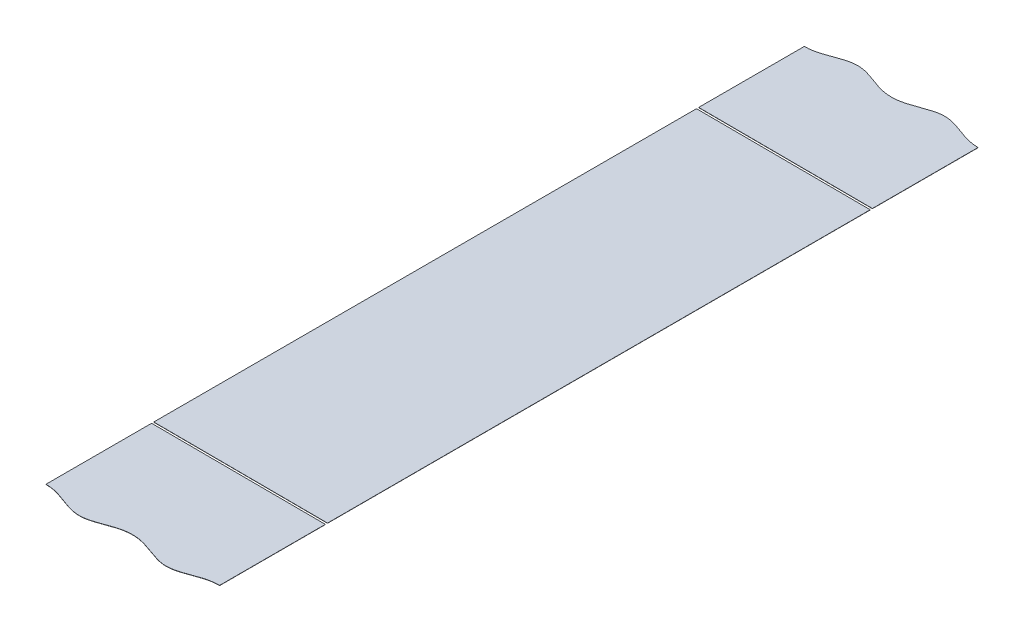
ISO-10303-21;
HEADER;
FILE_DESCRIPTION(('STEP AP214'),'2;1');
FILE_NAME('part.step','',(''),(''),'','','');
FILE_SCHEMA(('AUTOMOTIVE_DESIGN { 1 0 10303 214 1 1 1 1 }'));
ENDSEC;
DATA;
#1=APPLICATION_CONTEXT('core data for automotive mechanical design processes');
#2=APPLICATION_PROTOCOL_DEFINITION('international standard','automotive_design',2000,#1);
#3=PRODUCT_CONTEXT('',#1,'mechanical');
#4=PRODUCT('Part','Part','',(#3));
#5=PRODUCT_RELATED_PRODUCT_CATEGORY('part','',(#4));
#6=PRODUCT_DEFINITION_FORMATION('','',#4);
#7=PRODUCT_DEFINITION_CONTEXT('part definition',#1,'design');
#8=PRODUCT_DEFINITION('design','',#6,#7);
#9=PRODUCT_DEFINITION_SHAPE('','',#8);
#10=(LENGTH_UNIT() NAMED_UNIT(*) SI_UNIT(.MILLI.,.METRE.));
#11=(NAMED_UNIT(*) PLANE_ANGLE_UNIT() SI_UNIT($,.RADIAN.));
#12=(NAMED_UNIT(*) SI_UNIT($,.STERADIAN.) SOLID_ANGLE_UNIT());
#13=UNCERTAINTY_MEASURE_WITH_UNIT(LENGTH_MEASURE(1.E-05),#10,'distance_accuracy_value','');
#14=(GEOMETRIC_REPRESENTATION_CONTEXT(3) GLOBAL_UNCERTAINTY_ASSIGNED_CONTEXT((#13)) GLOBAL_UNIT_ASSIGNED_CONTEXT((#10,
#11,#12)) REPRESENTATION_CONTEXT('',''));
#15=CARTESIAN_POINT('',(0.,0.,0.));
#16=DIRECTION('',(0.,0.,1.));
#17=DIRECTION('',(1.,0.,0.));
#18=AXIS2_PLACEMENT_3D('',#15,#16,#17);
#19=CARTESIAN_POINT('',(4168.1005756017,241.081393417632,-3638.43675179829));
#20=DIRECTION('',(-0.00396825396825354,-0.999992126449225,0.));
#21=DIRECTION('',(0.999992126449225,-0.00396825396825354,0.));
#22=AXIS2_PLACEMENT_3D('',#19,#20,#21);
#23=PLANE('',#22);
#24=DIRECTION('',(0.,0.,1.));
#25=VECTOR('',#24,1.);
#26=CARTESIAN_POINT('',(702.95,254.83209920674,-173.258892942776));
#27=LINE('',#26,#25);
#28=CARTESIAN_POINT('',(702.95,254.83209920674,125.));
#29=VERTEX_POINT('',#28);
#30=CARTESIAN_POINT('',(702.95,254.83209920674,173.258892942778));
#31=VERTEX_POINT('',#30);
#32=EDGE_CURVE('E60',#29,#31,#27,.T.);
#33=ORIENTED_EDGE('',*,*,#32,.F.);
#34=DIRECTION('',(0.999992126449225,-0.00396825396825359,0.));
#35=VECTOR('',#34,1.);
#36=CARTESIAN_POINT('',(623.568727970466,255.147106734704,125.));
#37=LINE('',#36,#35);
#38=CARTESIAN_POINT('',(623.568727970466,255.147106734704,125.));
#39=VERTEX_POINT('',#38);
#40=EDGE_CURVE('E14',#39,#29,#37,.T.);
#41=ORIENTED_EDGE('',*,*,#40,.F.);
#42=DIRECTION('',(0.,0.,1.));
#43=VECTOR('',#42,1.);
#44=CARTESIAN_POINT('',(623.568727970466,255.147106734704,-173.258892942776));
#45=LINE('',#44,#43);
#46=CARTESIAN_POINT('',(623.568727970466,255.147106734704,173.258892942778));
#47=VERTEX_POINT('',#46);
#48=EDGE_CURVE('E99',#39,#47,#45,.T.);
#49=ORIENTED_EDGE('',*,*,#48,.T.);
#50=CARTESIAN_POINT('',(702.949999999999,254.83209920674,173.258892942778));
#51=CARTESIAN_POINT('',(701.68422899363,254.837122147107,173.262181964567));
#52=CARTESIAN_POINT('',(699.172229042036,254.847090479369,173.594043649429));
#53=CARTESIAN_POINT('',(697.270082255702,254.854638740334,174.060682929472));
#54=CARTESIAN_POINT('',(696.04662349184,254.859493773655,174.416832263334));
#55=CARTESIAN_POINT('',(694.840296012853,254.864280825152,174.812585823099));
#56=CARTESIAN_POINT('',(694.192108566333,254.866853017811,175.042429600881));
#57=CARTESIAN_POINT('',(693.671695664184,254.868918164635,175.226965213347));
#58=CARTESIAN_POINT('',(692.688110401866,254.872821311487,175.590430017711));
#59=CARTESIAN_POINT('',(692.089017730252,254.875198682077,175.813837373958));
#60=CARTESIAN_POINT('',(691.060219343337,254.879281247502,176.196387133234));
#61=CARTESIAN_POINT('',(690.582141485889,254.881178396795,176.368655333894));
#62=CARTESIAN_POINT('',(689.924126814083,254.883789586687,176.605761072537));
#63=CARTESIAN_POINT('',(689.37923722073,254.885951864002,176.787943810229));
#64=CARTESIAN_POINT('',(688.735479248461,254.888506479244,177.003182991211));
#65=CARTESIAN_POINT('',(687.516743056346,254.893342772054,177.360619471103));
#66=CARTESIAN_POINT('',(686.274490006288,254.898272386463,177.654620614531));
#67=CARTESIAN_POINT('',(685.017872425806,254.903259003426,177.863733960108));
#68=CARTESIAN_POINT('',(683.745174377142,254.908309432272,177.972702687079));
#69=CARTESIAN_POINT('',(682.468857623376,254.913374221173,177.970446612031));
#70=CARTESIAN_POINT('',(681.201141582182,254.918404879993,177.858558946605));
#71=CARTESIAN_POINT('',(679.941057024337,254.923405254911,177.645700578425));
#72=CARTESIAN_POINT('',(678.698193118115,254.928337293372,177.348581299583));
#73=CARTESIAN_POINT('',(677.476058328821,254.933187072784,176.988091569661));
#74=CARTESIAN_POINT('',(676.823802387974,254.935775410389,176.769001725331));
#75=CARTESIAN_POINT('',(676.277005403181,254.937945256778,176.585335071221));
#76=CARTESIAN_POINT('',(675.611889131558,254.940584627844,176.345009222586));
#77=CARTESIAN_POINT('',(675.10651054821,254.942590114203,176.162401245445));
#78=CARTESIAN_POINT('',(674.108031977849,254.946552361949,175.790352551658));
#79=CARTESIAN_POINT('',(673.452742495641,254.949152737511,175.54645203417));
#80=CARTESIAN_POINT('',(673.201943030092,254.950147981321,175.453902139972));
#81=CARTESIAN_POINT('',(672.52273282483,254.952843281135,175.20326032741));
#82=CARTESIAN_POINT('',(671.99684817901,254.954930141399,175.017436874896));
#83=CARTESIAN_POINT('',(671.354447508284,254.957479370481,174.79044201684));
#84=CARTESIAN_POINT('',(670.154590982691,254.962240743389,174.398791378027));
#85=CARTESIAN_POINT('',(668.928275087826,254.967107114621,174.044131462145));
#86=CARTESIAN_POINT('',(667.025022141484,254.974659765144,173.582330072409));
#87=CARTESIAN_POINT('',(664.512522065049,254.984630082044,173.257759265704));
#88=CARTESIAN_POINT('',(661.973551208773,254.994705442549,173.259910186328));
#89=CARTESIAN_POINT('',(659.459291308993,255.00468274293,173.588777752625));
#90=CARTESIAN_POINT('',(657.553976956267,255.012243573702,174.053907976769));
#91=CARTESIAN_POINT('',(656.326725230627,255.017113658577,174.410361999102));
#92=CARTESIAN_POINT('',(655.121848722104,255.021894952209,174.804901080956));
#93=CARTESIAN_POINT('',(654.210250272982,255.025512434855,175.127798721967));
#94=CARTESIAN_POINT('',(653.605769205923,255.027911188134,175.347135198893));
#95=CARTESIAN_POINT('',(653.109729966213,255.029879613314,175.530381794819));
#96=CARTESIAN_POINT('',(652.82135584475,255.031023964076,175.637418729192));
#97=CARTESIAN_POINT('',(652.333700540308,255.03295911941,175.819222063989));
#98=CARTESIAN_POINT('',(652.056773534054,255.034058044754,175.922195060746));
#99=CARTESIAN_POINT('',(651.328496107682,255.036948057295,176.192998945415));
#100=CARTESIAN_POINT('',(650.856739082017,255.038820123724,176.3630926515));
#101=CARTESIAN_POINT('',(650.189378143851,255.041468402267,176.603712057451));
#102=CARTESIAN_POINT('',(649.639862859984,255.043649035642,176.787455501291));
#103=CARTESIAN_POINT('',(648.991226750085,255.046223008725,177.004342339804));
#104=CARTESIAN_POINT('',(647.772803092478,255.051058061309,177.361352407472));
#105=CARTESIAN_POINT('',(646.530225361015,255.055988964146,177.655434399111));
#106=CARTESIAN_POINT('',(645.276912894528,255.060962465474,177.863499320998));
#107=CARTESIAN_POINT('',(644.020253803574,255.065949247162,177.971590688309));
#108=CARTESIAN_POINT('',(643.370039597925,255.068529482579,177.971592118867));
#109=CARTESIAN_POINT('',(642.714757532447,255.07112982871,177.969893734916));
#110=CARTESIAN_POINT('',(641.450639786084,255.07614620847,177.857095902083));
#111=CARTESIAN_POINT('',(640.198536683787,255.081114910696,177.645252564257));
#112=CARTESIAN_POINT('',(638.958875873977,255.086034238356,177.348985097284));
#113=CARTESIAN_POINT('',(637.741556649385,255.090864908234,176.989998054833));
#114=CARTESIAN_POINT('',(637.095401112578,255.093429037696,176.773175791965));
#115=CARTESIAN_POINT('',(636.547750628174,255.095602271015,176.589407626987));
#116=CARTESIAN_POINT('',(635.882185119416,255.098243424782,176.349029955348));
#117=CARTESIAN_POINT('',(635.376461009202,255.10025028229,176.166381091329));
#118=CARTESIAN_POINT('',(634.381403352169,255.104198954876,175.795652436497));
#119=CARTESIAN_POINT('',(633.731190795399,255.10677918375,175.553614996835));
#120=CARTESIAN_POINT('',(633.484492236871,255.107758153992,175.46253320474));
#121=CARTESIAN_POINT('',(632.803922669696,255.110458848142,175.211265032792));
#122=CARTESIAN_POINT('',(632.279350529977,255.112540500007,175.025687758424));
#123=CARTESIAN_POINT('',(631.632700386287,255.11510659221,174.796923090899));
#124=CARTESIAN_POINT('',(630.43445146361,255.119861585691,174.405274388551));
#125=CARTESIAN_POINT('',(629.222142717166,255.124672372563,174.053649251437));
#126=CARTESIAN_POINT('',(627.327236131078,255.132191902348,173.590508998445));
#127=CARTESIAN_POINT('',(624.826350678899,255.142116129107,173.262160753963));
#128=CARTESIAN_POINT('',(623.568727970465,255.147106734704,173.258892942778));
#129=B_SPLINE_CURVE_WITH_KNOTS('',2,(#50,#51,#52,#53,#54,#55,#56,#57,#58,#59,#60,#61,#62,#63,
#64,#65,#66,#67,#68,#69,#70,#71,#72,#73,#74,#75,#76,#77,#78,#79,#80,#81,#82,#83,#84,#85,#86,#87,
#88,#89,#90,#91,#92,#93,#94,#95,#96,#97,#98,#99,#100,#101,#102,#103,#104,#105,#106,#107,#108,
#109,#110,#111,#112,#113,#114,#115,#116,#117,#118,#119,#120,#121,#122,#123,#124,#125,#126,#127,
#128),.UNSPECIFIED.,.F.,.F.,(3,1,1,1,1,2,1,1,1,2,2,1,1,1,1,1,1,1,1,1,2,2,1,1,2,2,1,1,1,1,1,1,1,
1,1,1,1,1,1,1,2,2,2,1,1,1,1,1,1,1,1,1,1,2,2,1,1,2,2,1,1,1,1,3),(0.,0.03125,0.0625,0.078125,
0.09375,0.109375,0.125,0.1328125,0.140625,0.15625,0.171875,0.1875,0.203125,0.21875,0.234375,
0.25,0.265625,0.28125,0.296875,0.3125,0.328125,0.34375,0.359375,0.3671875,0.375,0.390625,
0.40625,0.421875,0.4375,0.46875,0.5,0.53125,0.5625,0.578125,0.59375,0.609375,0.6171875,0.625,
0.62890625,0.6328125,0.640625,0.65625,0.671875,0.6875,0.703125,0.71875,0.734146118164062,
0.749542236328125,0.75,0.765625,0.78125,0.796875,0.8125,0.828125,0.84375,0.859375,0.8671875,
0.875,0.890625,0.90625,0.921875,0.9375,0.96875,1.),.UNSPECIFIED.);
#130=EDGE_CURVE('E121',#31,#47,#129,.T.);
#131=ORIENTED_EDGE('',*,*,#130,.F.);
#132=EDGE_LOOP('',(#33,#41,#49,#131));
#133=FACE_BOUND('',#132,.T.);
#134=ADVANCED_FACE('F57',(#133),#23,.F.);
#135=CARTESIAN_POINT('',(4168.10017877631,240.981394204987,-3638.43675179829));
#136=DIRECTION('',(-0.00396825396825354,-0.999992126449225,0.));
#137=DIRECTION('',(0.999992126449225,-0.00396825396825354,0.));
#138=AXIS2_PLACEMENT_3D('',#135,#136,#137);
#139=PLANE('',#138);
#140=DIRECTION('',(-0.999992126449225,0.00396825396825354,0.));
#141=VECTOR('',#140,1.);
#142=CARTESIAN_POINT('',(4168.1001787763,240.981394204987,125.));
#143=LINE('',#142,#141);
#144=CARTESIAN_POINT('',(702.949603174603,254.732099994095,125.));
#145=VERTEX_POINT('',#144);
#146=CARTESIAN_POINT('',(623.568331145069,255.047107522059,125.));
#147=VERTEX_POINT('',#146);
#148=EDGE_CURVE('E83',#145,#147,#143,.T.);
#149=ORIENTED_EDGE('',*,*,#148,.F.);
#150=DIRECTION('',(0.,0.,1.));
#151=VECTOR('',#150,1.);
#152=CARTESIAN_POINT('',(702.949603174603,254.732099994095,-173.258892942776));
#153=LINE('',#152,#151);
#154=CARTESIAN_POINT('',(702.949603174603,254.732099994095,173.258892942778));
#155=VERTEX_POINT('',#154);
#156=EDGE_CURVE('E105',#145,#155,#153,.T.);
#157=ORIENTED_EDGE('',*,*,#156,.T.);
#158=CARTESIAN_POINT('',(702.949603174603,254.732099994095,173.258892942778));
#159=CARTESIAN_POINT('',(701.683832168233,254.737122934462,173.262181964567));
#160=CARTESIAN_POINT('',(699.171832216639,254.747091266725,173.594043649429));
#161=CARTESIAN_POINT('',(697.269685430305,254.754639527689,174.060682929472));
#162=CARTESIAN_POINT('',(696.046226666443,254.75949456101,174.416832263334));
#163=CARTESIAN_POINT('',(694.839899187456,254.764281612507,174.812585823099));
#164=CARTESIAN_POINT('',(694.191711740937,254.766853805166,175.042429600881));
#165=CARTESIAN_POINT('',(693.671298838787,254.76891895199,175.226965213347));
#166=CARTESIAN_POINT('',(692.687713576469,254.772822098842,175.590430017711));
#167=CARTESIAN_POINT('',(692.088620904855,254.775199469432,175.813837373958));
#168=CARTESIAN_POINT('',(691.05982251794,254.779282034857,176.196387133234));
#169=CARTESIAN_POINT('',(690.581744660492,254.78117918415,176.368655333894));
#170=CARTESIAN_POINT('',(689.923729988686,254.783790374042,176.605761072537));
#171=CARTESIAN_POINT('',(689.378840395333,254.785952651358,176.787943810229));
#172=CARTESIAN_POINT('',(688.735082423064,254.7885072666,177.003182991211));
#173=CARTESIAN_POINT('',(687.516346230949,254.793343559409,177.360619471103));
#174=CARTESIAN_POINT('',(686.274093180891,254.798273173818,177.654620614531));
#175=CARTESIAN_POINT('',(685.017475600409,254.803259790781,177.863733960108));
#176=CARTESIAN_POINT('',(683.744777551745,254.808310219627,177.972702687079));
#177=CARTESIAN_POINT('',(682.46846079798,254.813375008528,177.970446612031));
#178=CARTESIAN_POINT('',(681.200744756785,254.818405667348,177.858558946605));
#179=CARTESIAN_POINT('',(679.94066019894,254.823406042266,177.645700578425));
#180=CARTESIAN_POINT('',(678.697796292718,254.828338080727,177.348581299583));
#181=CARTESIAN_POINT('',(677.475661503424,254.833187860139,176.988091569661));
#182=CARTESIAN_POINT('',(676.823405562577,254.835776197744,176.769001725331));
#183=CARTESIAN_POINT('',(676.276608577784,254.837946044133,176.585335071221));
#184=CARTESIAN_POINT('',(675.611492306161,254.840585415199,176.345009222586));
#185=CARTESIAN_POINT('',(675.106113722813,254.842590901558,176.162401245445));
#186=CARTESIAN_POINT('',(674.107635152452,254.846553149304,175.790352551658));
#187=CARTESIAN_POINT('',(673.452345670244,254.849153524866,175.54645203417));
#188=CARTESIAN_POINT('',(673.201546204696,254.850148768677,175.453902139972));
#189=CARTESIAN_POINT('',(672.522335999434,254.85284406849,175.20326032741));
#190=CARTESIAN_POINT('',(671.996451353613,254.854930928754,175.017436874896));
#191=CARTESIAN_POINT('',(671.354050682887,254.857480157836,174.79044201684));
#192=CARTESIAN_POINT('',(670.154194157294,254.862241530744,174.398791378027));
#193=CARTESIAN_POINT('',(668.927878262429,254.867107901976,174.044131462145));
#194=CARTESIAN_POINT('',(667.024625316087,254.874660552499,173.582330072409));
#195=CARTESIAN_POINT('',(664.512125239652,254.8846308694,173.257759265704));
#196=CARTESIAN_POINT('',(661.973154383376,254.894706229904,173.259910186328));
#197=CARTESIAN_POINT('',(659.458894483596,254.904683530285,173.588777752625));
#198=CARTESIAN_POINT('',(657.55358013087,254.912244361057,174.053907976769));
#199=CARTESIAN_POINT('',(656.32632840523,254.917114445932,174.410361999102));
#200=CARTESIAN_POINT('',(655.121451896707,254.921895739564,174.804901080956));
#201=CARTESIAN_POINT('',(654.209853447585,254.92551322221,175.127798721967));
#202=CARTESIAN_POINT('',(653.605372380526,254.927911975489,175.347135198893));
#203=CARTESIAN_POINT('',(653.109333140816,254.929880400669,175.530381794819));
#204=CARTESIAN_POINT('',(652.820959019353,254.931024751431,175.637418729192));
#205=CARTESIAN_POINT('',(652.333303714912,254.932959906765,175.819222063989));
#206=CARTESIAN_POINT('',(652.056376708657,254.934058832109,175.922195060746));
#207=CARTESIAN_POINT('',(651.328099282285,254.936948844651,176.192998945415));
#208=CARTESIAN_POINT('',(650.85634225662,254.93882091108,176.3630926515));
#209=CARTESIAN_POINT('',(650.188981318454,254.941469189622,176.603712057451));
#210=CARTESIAN_POINT('',(649.639466034588,254.943649822997,176.787455501291));
#211=CARTESIAN_POINT('',(648.990829924688,254.946223796081,177.004342339804));
#212=CARTESIAN_POINT('',(647.772406267081,254.951058848664,177.361352407472));
#213=CARTESIAN_POINT('',(646.529828535619,254.955989751501,177.655434399111));
#214=CARTESIAN_POINT('',(645.276516069132,254.960963252829,177.863499320998));
#215=CARTESIAN_POINT('',(644.019856978177,254.965950034517,177.971590688309));
#216=CARTESIAN_POINT('',(643.369642772529,254.968530269935,177.971592118867));
#217=CARTESIAN_POINT('',(642.71436070705,254.971130616065,177.969893734916));
#218=CARTESIAN_POINT('',(641.450242960687,254.976146995825,177.857095902083));
#219=CARTESIAN_POINT('',(640.198139858391,254.981115698051,177.645252564257));
#220=CARTESIAN_POINT('',(638.95847904858,254.986035025711,177.348985097284));
#221=CARTESIAN_POINT('',(637.741159823988,254.990865695589,176.989998054833));
#222=CARTESIAN_POINT('',(637.095004287181,254.993429825051,176.773175791965));
#223=CARTESIAN_POINT('',(636.547353802777,254.99560305837,176.589407626987));
#224=CARTESIAN_POINT('',(635.881788294019,254.998244212137,176.349029955348));
#225=CARTESIAN_POINT('',(635.376064183805,255.000251069645,176.166381091329));
#226=CARTESIAN_POINT('',(634.381006526772,255.004199742231,175.795652436497));
#227=CARTESIAN_POINT('',(633.730793970003,255.006779971106,175.553614996835));
#228=CARTESIAN_POINT('',(633.484095411475,255.007758941347,175.46253320474));
#229=CARTESIAN_POINT('',(632.803525844299,255.010459635497,175.211265032792));
#230=CARTESIAN_POINT('',(632.27895370458,255.012541287362,175.025687758424));
#231=CARTESIAN_POINT('',(631.632303560889,255.015107379565,174.796923090899));
#232=CARTESIAN_POINT('',(630.434054638213,255.019862373046,174.405274388551));
#233=CARTESIAN_POINT('',(629.221745891769,255.024673159918,174.053649251437));
#234=CARTESIAN_POINT('',(627.326839305681,255.032192689703,173.590508998445));
#235=CARTESIAN_POINT('',(624.825953853502,255.042116916462,173.262160753963));
#236=CARTESIAN_POINT('',(623.568331145068,255.047107522059,173.258892942778));
#237=B_SPLINE_CURVE_WITH_KNOTS('',2,(#158,#159,#160,#161,#162,#163,#164,#165,#166,#167,#168,
#169,#170,#171,#172,#173,#174,#175,#176,#177,#178,#179,#180,#181,#182,#183,#184,#185,#186,#187,
#188,#189,#190,#191,#192,#193,#194,#195,#196,#197,#198,#199,#200,#201,#202,#203,#204,#205,#206,
#207,#208,#209,#210,#211,#212,#213,#214,#215,#216,#217,#218,#219,#220,#221,#222,#223,#224,#225,
#226,#227,#228,#229,#230,#231,#232,#233,#234,#235,#236),.UNSPECIFIED.,.F.,.F.,(3,1,1,1,1,2,1,1,
1,2,2,1,1,1,1,1,1,1,1,1,2,2,1,1,2,2,1,1,1,1,1,1,1,1,1,1,1,1,1,1,2,2,2,1,1,1,1,1,1,1,1,1,1,2,2,1,
1,2,2,1,1,1,1,3),(0.,0.03125,0.0625,0.078125,0.09375,0.109375,0.125,0.1328125,0.140625,0.15625,
0.171875,0.1875,0.203125,0.21875,0.234375,0.25,0.265625,0.28125,0.296875,0.3125,0.328125,
0.34375,0.359375,0.3671875,0.375,0.390625,0.40625,0.421875,0.4375,0.46875,0.5,0.53125,0.5625,
0.578125,0.59375,0.609375,0.6171875,0.625,0.62890625,0.6328125,0.640625,0.65625,0.671875,0.6875,
0.703125,0.71875,0.734146118164062,0.749542236328125,0.75,0.765625,0.78125,0.796875,0.8125,
0.828125,0.84375,0.859375,0.8671875,0.875,0.890625,0.90625,0.921875,0.9375,0.96875,1.),.UNSPECIFIED.);
#238=CARTESIAN_POINT('',(623.568331145069,255.047107522059,173.258892942778));
#239=VERTEX_POINT('',#238);
#240=EDGE_CURVE('E109',#155,#239,#237,.T.);
#241=ORIENTED_EDGE('',*,*,#240,.T.);
#242=DIRECTION('',(0.,0.,1.));
#243=VECTOR('',#242,1.);
#244=CARTESIAN_POINT('',(623.568331145069,255.047107522059,-173.258892942776));
#245=LINE('',#244,#243);
#246=EDGE_CURVE('E118',#147,#239,#245,.T.);
#247=ORIENTED_EDGE('',*,*,#246,.F.);
#248=EDGE_LOOP('',(#149,#157,#241,#247));
#249=FACE_BOUND('',#248,.T.);
#250=ADVANCED_FACE('F107',(#249),#139,.T.);
#251=CARTESIAN_POINT('',(623.568331145069,255.047107522059,-173.258892942776));
#252=DIRECTION('',(-0.999992126449225,0.00396825396825353,0.));
#253=DIRECTION('',(-0.00396825396825353,-0.999992126449225,0.));
#254=AXIS2_PLACEMENT_3D('',#251,#252,#253);
#255=PLANE('',#254);
#256=DIRECTION('',(0.00396825396825354,0.999992126449225,0.));
#257=VECTOR('',#256,1.);
#258=CARTESIAN_POINT('',(623.529045430783,245.147185470212,125.));
#259=LINE('',#258,#257);
#260=EDGE_CURVE('E66',#147,#39,#259,.T.);
#261=ORIENTED_EDGE('',*,*,#260,.F.);
#262=ORIENTED_EDGE('',*,*,#246,.T.);
#263=DIRECTION('',(0.00396825396825353,0.999992126449225,0.));
#264=VECTOR('',#263,1.);
#265=CARTESIAN_POINT('',(623.568331145069,255.047107522059,173.258892942778));
#266=LINE('',#265,#264);
#267=EDGE_CURVE('E117',#239,#47,#266,.T.);
#268=ORIENTED_EDGE('',*,*,#267,.T.);
#269=ORIENTED_EDGE('',*,*,#48,.F.);
#270=EDGE_LOOP('',(#261,#262,#268,#269));
#271=FACE_BOUND('',#270,.T.);
#272=ADVANCED_FACE('F147',(#271),#255,.T.);
#273=CARTESIAN_POINT('',(702.949603174603,254.732099994095,-173.258892942776));
#274=DIRECTION('',(-0.999992126449225,0.00396825396825353,0.));
#275=DIRECTION('',(-0.00396825396825353,-0.999992126449225,0.));
#276=AXIS2_PLACEMENT_3D('',#273,#274,#275);
#277=PLANE('',#276);
#278=ORIENTED_EDGE('',*,*,#156,.F.);
#279=DIRECTION('',(0.00396825396825353,0.999992126449225,0.));
#280=VECTOR('',#279,1.);
#281=CARTESIAN_POINT('',(702.949603174603,254.732099994095,125.));
#282=LINE('',#281,#280);
#283=EDGE_CURVE('E74',#145,#29,#282,.T.);
#284=ORIENTED_EDGE('',*,*,#283,.T.);
#285=ORIENTED_EDGE('',*,*,#32,.T.);
#286=DIRECTION('',(0.00396825396825353,0.999992126449225,0.));
#287=VECTOR('',#286,1.);
#288=CARTESIAN_POINT('',(702.949603174603,254.732099994095,173.258892942778));
#289=LINE('',#288,#287);
#290=EDGE_CURVE('E116',#155,#31,#289,.T.);
#291=ORIENTED_EDGE('',*,*,#290,.F.);
#292=EDGE_LOOP('',(#278,#284,#285,#291));
#293=FACE_BOUND('',#292,.T.);
#294=ADVANCED_FACE('F120',(#293),#277,.F.);
#295=DIRECTION('',(0.00396825396825353,0.999992126449225,0.));
#296=VECTOR('',#295,1.);
#297=SURFACE_OF_LINEAR_EXTRUSION('',#237,#296);
#298=ORIENTED_EDGE('',*,*,#130,.T.);
#299=ORIENTED_EDGE('',*,*,#267,.F.);
#300=ORIENTED_EDGE('',*,*,#240,.F.);
#301=ORIENTED_EDGE('',*,*,#290,.T.);
#302=EDGE_LOOP('',(#298,#299,#300,#301));
#303=FACE_BOUND('',#302,.T.);
#304=ADVANCED_FACE('F115',(#303),#297,.F.);
#305=CARTESIAN_POINT('',(623.529045430783,245.147185470212,125.));
#306=DIRECTION('',(0.,0.,1.));
#307=DIRECTION('',(1.,0.,0.));
#308=AXIS2_PLACEMENT_3D('',#305,#306,#307);
#309=PLANE('',#308);
#310=ORIENTED_EDGE('',*,*,#148,.T.);
#311=ORIENTED_EDGE('',*,*,#260,.T.);
#312=ORIENTED_EDGE('',*,*,#40,.T.);
#313=ORIENTED_EDGE('',*,*,#283,.F.);
#314=EDGE_LOOP('',(#310,#311,#312,#313));
#315=FACE_BOUND('',#314,.T.);
#316=ADVANCED_FACE('F142',(#315),#309,.F.);
#317=CLOSED_SHELL('',(#134,#250,#272,#294,#304,#316));
#318=MANIFOLD_SOLID_BREP('B2',#317);
#319=CARTESIAN_POINT('',(702.949603174603,254.732099994095,-173.258892942776));
#320=DIRECTION('',(-0.999992126449225,0.00396825396825353,0.));
#321=DIRECTION('',(-0.00396825396825353,-0.999992126449225,0.));
#322=AXIS2_PLACEMENT_3D('',#319,#320,#321);
#323=PLANE('',#322);
#324=DIRECTION('',(0.,0.,1.));
#325=VECTOR('',#324,1.);
#326=CARTESIAN_POINT('',(702.95,254.83209920674,-173.258892942776));
#327=LINE('',#326,#325);
#328=CARTESIAN_POINT('',(702.949999999999,254.83209920674,-173.258892942774));
#329=VERTEX_POINT('',#328);
#330=CARTESIAN_POINT('',(702.95,254.83209920674,-125.));
#331=VERTEX_POINT('',#330);
#332=EDGE_CURVE('E198',#329,#331,#327,.T.);
#333=ORIENTED_EDGE('',*,*,#332,.T.);
#334=DIRECTION('',(0.00396825396825354,0.999992126449225,0.));
#335=VECTOR('',#334,1.);
#336=CARTESIAN_POINT('',(702.910317460318,244.832177942248,-125.));
#337=LINE('',#336,#335);
#338=CARTESIAN_POINT('',(702.949603174603,254.732099994095,-125.));
#339=VERTEX_POINT('',#338);
#340=EDGE_CURVE('E204',#339,#331,#337,.T.);
#341=ORIENTED_EDGE('',*,*,#340,.F.);
#342=DIRECTION('',(0.,0.,1.));
#343=VECTOR('',#342,1.);
#344=CARTESIAN_POINT('',(702.949603174603,254.732099994095,-173.258892942776));
#345=LINE('',#344,#343);
#346=CARTESIAN_POINT('',(702.949603174603,254.732099994095,-173.258892942774));
#347=VERTEX_POINT('',#346);
#348=EDGE_CURVE('E255',#347,#339,#345,.T.);
#349=ORIENTED_EDGE('',*,*,#348,.F.);
#350=DIRECTION('',(0.00396825396825353,0.999992126449225,0.));
#351=VECTOR('',#350,1.);
#352=CARTESIAN_POINT('',(702.949603174603,254.732099994095,-173.258892942774));
#353=LINE('',#352,#351);
#354=EDGE_CURVE('E239',#347,#329,#353,.T.);
#355=ORIENTED_EDGE('',*,*,#354,.T.);
#356=EDGE_LOOP('',(#333,#341,#349,#355));
#357=FACE_BOUND('',#356,.T.);
#358=ADVANCED_FACE('F195',(#357),#323,.F.);
#359=CARTESIAN_POINT('',(623.568331145069,255.047107522059,-173.258892942776));
#360=DIRECTION('',(-0.999992126449225,0.00396825396825353,0.));
#361=DIRECTION('',(-0.00396825396825353,-0.999992126449225,0.));
#362=AXIS2_PLACEMENT_3D('',#359,#360,#361);
#363=PLANE('',#362);
#364=DIRECTION('',(0.00396825396825354,0.999992126449225,0.));
#365=VECTOR('',#364,1.);
#366=CARTESIAN_POINT('',(623.529045430783,245.147185470212,-125.));
#367=LINE('',#366,#365);
#368=CARTESIAN_POINT('',(623.568331145068,255.047107522059,-125.));
#369=VERTEX_POINT('',#368);
#370=CARTESIAN_POINT('',(623.568727970466,255.147106734704,-125.));
#371=VERTEX_POINT('',#370);
#372=EDGE_CURVE('E211',#369,#371,#367,.T.);
#373=ORIENTED_EDGE('',*,*,#372,.T.);
#374=DIRECTION('',(0.,0.,1.));
#375=VECTOR('',#374,1.);
#376=CARTESIAN_POINT('',(623.568727970466,255.147106734704,-173.258892942776));
#377=LINE('',#376,#375);
#378=CARTESIAN_POINT('',(623.568727970466,255.147106734704,-173.258892942774));
#379=VERTEX_POINT('',#378);
#380=EDGE_CURVE('E247',#379,#371,#377,.T.);
#381=ORIENTED_EDGE('',*,*,#380,.F.);
#382=DIRECTION('',(0.00396825396825353,0.999992126449225,0.));
#383=VECTOR('',#382,1.);
#384=CARTESIAN_POINT('',(623.568331145069,255.047107522059,-173.258892942774));
#385=LINE('',#384,#383);
#386=CARTESIAN_POINT('',(623.568331145069,255.047107522059,-173.258892942774));
#387=VERTEX_POINT('',#386);
#388=EDGE_CURVE('E230',#387,#379,#385,.T.);
#389=ORIENTED_EDGE('',*,*,#388,.F.);
#390=DIRECTION('',(0.,0.,1.));
#391=VECTOR('',#390,1.);
#392=CARTESIAN_POINT('',(623.568331145069,255.047107522059,-173.258892942776));
#393=LINE('',#392,#391);
#394=EDGE_CURVE('E245',#387,#369,#393,.T.);
#395=ORIENTED_EDGE('',*,*,#394,.T.);
#396=EDGE_LOOP('',(#373,#381,#389,#395));
#397=FACE_BOUND('',#396,.T.);
#398=ADVANCED_FACE('F244',(#397),#363,.T.);
#399=CARTESIAN_POINT('',(4168.10017877631,240.981394204987,-3638.43675179829));
#400=DIRECTION('',(-0.00396825396825354,-0.999992126449225,0.));
#401=DIRECTION('',(0.999992126449225,-0.00396825396825354,0.));
#402=AXIS2_PLACEMENT_3D('',#399,#400,#401);
#403=PLANE('',#402);
#404=DIRECTION('',(0.999992126449225,-0.00396825396825354,0.));
#405=VECTOR('',#404,1.);
#406=CARTESIAN_POINT('',(4168.10017877631,240.981394204987,-125.));
#407=LINE('',#406,#405);
#408=EDGE_CURVE('E220',#369,#339,#407,.T.);
#409=ORIENTED_EDGE('',*,*,#408,.F.);
#410=ORIENTED_EDGE('',*,*,#394,.F.);
#411=CARTESIAN_POINT('',(702.949603174603,254.732099994095,-173.258892942774));
#412=CARTESIAN_POINT('',(701.683827687561,254.737122952243,-173.262182874902));
#413=CARTESIAN_POINT('',(699.171836459137,254.747091249889,-173.594042787693));
#414=CARTESIAN_POINT('',(697.269689315608,254.754639512271,-174.060681893787));
#415=CARTESIAN_POINT('',(696.046230708835,254.759494544969,-174.416830998314));
#416=CARTESIAN_POINT('',(694.839901844391,254.764281601963,-174.812584897375));
#417=CARTESIAN_POINT('',(694.191711740936,254.766853805166,-175.042429600877));
#418=CARTESIAN_POINT('',(693.67129766706,254.76891895664,-175.226965615653));
#419=CARTESIAN_POINT('',(692.990310259643,254.771621308899,-175.478611298513));
#420=CARTESIAN_POINT('',(692.747699359756,254.772584058145,-175.568263449061));
#421=CARTESIAN_POINT('',(692.088666847569,254.775199287118,-175.81364953755));
#422=CARTESIAN_POINT('',(691.093982985173,254.779146476381,-176.184077851584));
#423=CARTESIAN_POINT('',(690.581744660492,254.78117918415,-176.36865533389));
#424=CARTESIAN_POINT('',(689.923738362315,254.783790340813,-176.60575814328));
#425=CARTESIAN_POINT('',(689.378840395333,254.785952651358,-176.787943810225));
#426=CARTESIAN_POINT('',(688.735090762671,254.788507233506,-177.003180355926));
#427=CARTESIAN_POINT('',(687.516354353281,254.793343527177,-177.360617303499));
#428=CARTESIAN_POINT('',(686.274100810255,254.798273143542,-177.654619074787));
#429=CARTESIAN_POINT('',(685.017482845578,254.80325976203,-177.863733039406));
#430=CARTESIAN_POINT('',(683.744784266506,254.808310192981,-177.972702423604));
#431=CARTESIAN_POINT('',(682.468466765147,254.813374984849,-177.970446895256));
#432=CARTESIAN_POINT('',(681.200750313697,254.818405645297,-177.858559674117));
#433=CARTESIAN_POINT('',(679.940665005426,254.823406023193,-177.645701590805));
#434=CARTESIAN_POINT('',(678.697800160452,254.828338065378,-177.348582349134));
#435=CARTESIAN_POINT('',(677.475664480779,254.833187848324,-176.988092529494));
#436=CARTESIAN_POINT('',(676.823405562577,254.835776197744,-176.769001725327));
#437=CARTESIAN_POINT('',(676.276609526989,254.837946040366,-176.585335423788));
#438=CARTESIAN_POINT('',(675.611492306161,254.840585415199,-176.345009222583));
#439=CARTESIAN_POINT('',(675.142783894113,254.842445383859,-176.175651237836));
#440=CARTESIAN_POINT('',(674.107819628906,254.846552417249,-175.79059120359));
#441=CARTESIAN_POINT('',(673.505696695162,254.848941812783,-175.566139623745));
#442=CARTESIAN_POINT('',(672.522344038894,254.852844036588,-175.203263247531));
#443=CARTESIAN_POINT('',(671.996451353613,254.854930928754,-175.017436874892));
#444=CARTESIAN_POINT('',(671.35405874779,254.857480125833,-174.790444769676));
#445=CARTESIAN_POINT('',(670.15420204657,254.862241499437,-174.398793817513));
#446=CARTESIAN_POINT('',(668.927885815417,254.867107872004,-174.044133473883));
#447=CARTESIAN_POINT('',(667.02463276813,254.874660522927,-173.582331496921));
#448=CARTESIAN_POINT('',(664.512132140607,254.884630842015,-173.257759667183));
#449=CARTESIAN_POINT('',(661.973094469796,254.894706467658,-173.259909829808));
#450=CARTESIAN_POINT('',(659.458713503175,254.904684248467,-173.58880913888));
#451=CARTESIAN_POINT('',(657.553256616199,254.912245644855,-174.053992899082));
#452=CARTESIAN_POINT('',(656.325834295434,254.917116406701,-174.410513754548));
#453=CARTESIAN_POINT('',(655.12069307553,254.921898750783,-174.805158404206));
#454=CARTESIAN_POINT('',(654.471954052225,254.924473132256,-175.034959837896));
#455=CARTESIAN_POINT('',(653.946831541724,254.926556968149,-175.220972859219));
#456=CARTESIAN_POINT('',(653.260356654747,254.929281096292,-175.474591032525));
#457=CARTESIAN_POINT('',(653.01648133506,254.930248863117,-175.564690778732));
#458=CARTESIAN_POINT('',(652.360210899974,254.93285313138,-175.8090342274));
#459=CARTESIAN_POINT('',(651.368033702623,254.936790373481,-176.178572634859));
#460=CARTESIAN_POINT('',(650.858628597056,254.938811838229,-176.362268465707));
#461=CARTESIAN_POINT('',(650.191560488049,254.941458954741,-176.602818921872));
#462=CARTESIAN_POINT('',(649.640949812222,254.943643934944,-176.786959513089));
#463=CARTESIAN_POINT('',(648.992604859925,254.946216752631,-177.00378535405));
#464=CARTESIAN_POINT('',(647.773919632869,254.951052843197,-177.360950580763));
#465=CARTESIAN_POINT('',(646.530902947001,254.955985487931,-177.655228271128));
#466=CARTESIAN_POINT('',(645.277008485456,254.960961298781,-177.863446795195));
#467=CARTESIAN_POINT('',(644.019965972456,254.965949601997,-177.97159189601));
#468=CARTESIAN_POINT('',(643.369632099506,254.968530312288,-177.971592082696));
#469=CARTESIAN_POINT('',(642.714366687703,254.971130592332,-177.969894035645));
#470=CARTESIAN_POINT('',(641.450248250696,254.976146974833,-177.857096598641));
#471=CARTESIAN_POINT('',(640.198144725094,254.981115678738,-177.645253576713));
#472=CARTESIAN_POINT('',(638.958483052778,254.986035009822,-177.348986192579));
#473=CARTESIAN_POINT('',(637.741162718092,254.990865684105,-176.989998984173));
#474=CARTESIAN_POINT('',(637.095004287181,254.993429825051,-176.773175791961));
#475=CARTESIAN_POINT('',(636.547354898458,254.995603054022,-176.58940803007));
#476=CARTESIAN_POINT('',(635.881788294019,254.998244212137,-176.349029955345));
#477=CARTESIAN_POINT('',(635.411717865552,255.000109585667,-176.179257878701));
#478=CARTESIAN_POINT('',(634.38124707934,255.00419878765,-175.795908228867));
#479=CARTESIAN_POINT('',(633.785159666115,255.006564232518,-175.573686982726));
#480=CARTESIAN_POINT('',(632.803534161156,255.010459602493,-175.211268057978));
#481=CARTESIAN_POINT('',(632.27895370458,255.012541287362,-175.025687758421));
#482=CARTESIAN_POINT('',(631.632311727463,255.015107347158,-174.796925877731));
#483=CARTESIAN_POINT('',(630.434062243796,255.019862342865,-174.405276743359));
#484=CARTESIAN_POINT('',(629.221753372791,255.024673130231,-174.05365125996));
#485=CARTESIAN_POINT('',(627.326846535829,255.032192661012,-173.590510373526));
#486=CARTESIAN_POINT('',(624.825964479165,255.042116874296,-173.26216170116));
#487=CARTESIAN_POINT('',(623.568331145068,255.047107522059,-173.258892942774));
#488=B_SPLINE_CURVE_WITH_KNOTS('',2,(#411,#412,#413,#414,#415,#416,#417,#418,#419,#420,#421,
#422,#423,#424,#425,#426,#427,#428,#429,#430,#431,#432,#433,#434,#435,#436,#437,#438,#439,#440,
#441,#442,#443,#444,#445,#446,#447,#448,#449,#450,#451,#452,#453,#454,#455,#456,#457,#458,#459,
#460,#461,#462,#463,#464,#465,#466,#467,#468,#469,#470,#471,#472,#473,#474,#475,#476,#477,#478,
#479,#480,#481,#482,#483,#484,#485,#486,#487),.UNSPECIFIED.,.F.,.F.,(3,1,1,1,1,2,2,1,1,2,2,1,1,
1,1,1,1,1,1,1,2,2,1,1,1,2,1,1,1,1,1,1,1,1,1,2,2,1,1,2,2,1,1,1,1,1,1,1,1,1,1,2,2,1,1,1,2,1,1,1,1,
3),(0.,0.03125,0.0625,0.078125,0.09375,0.109375,0.125,0.1328125,0.140625,0.15625,0.171875,
0.1875,0.203125,0.21875,0.234375,0.25,0.265625,0.28125,0.296875,0.3125,0.328125,0.34375,
0.359375,0.3671875,0.375,0.390625,0.40625,0.421875,0.4375,0.46875,0.5,0.53125,0.5625,0.578125,
0.59375,0.609375,0.625,0.6328125,0.640625,0.65625,0.671875,0.6875,0.703125,0.71875,
0.734146595001221,0.749543190002441,0.75,0.765625,0.78125,0.796875,0.8125,0.828125,0.84375,
0.859375,0.8671875,0.875,0.890625,0.90625,0.921875,0.9375,0.96875,1.),.UNSPECIFIED.);
#489=EDGE_CURVE('E249',#347,#387,#488,.T.);
#490=ORIENTED_EDGE('',*,*,#489,.F.);
#491=ORIENTED_EDGE('',*,*,#348,.T.);
#492=EDGE_LOOP('',(#409,#410,#490,#491));
#493=FACE_BOUND('',#492,.T.);
#494=ADVANCED_FACE('F253',(#493),#403,.T.);
#495=CARTESIAN_POINT('',(4168.1005756017,241.081393417632,-3638.43675179829));
#496=DIRECTION('',(-0.00396825396825354,-0.999992126449225,0.));
#497=DIRECTION('',(0.999992126449225,-0.00396825396825354,0.));
#498=AXIS2_PLACEMENT_3D('',#495,#496,#497);
#499=PLANE('',#498);
#500=ORIENTED_EDGE('',*,*,#380,.T.);
#501=DIRECTION('',(-0.999992126449225,0.00396825396825359,0.));
#502=VECTOR('',#501,1.);
#503=CARTESIAN_POINT('',(623.568727970466,255.147106734704,-125.));
#504=LINE('',#503,#502);
#505=EDGE_CURVE('E55',#331,#371,#504,.T.);
#506=ORIENTED_EDGE('',*,*,#505,.F.);
#507=ORIENTED_EDGE('',*,*,#332,.F.);
#508=CARTESIAN_POINT('',(702.949999999999,254.83209920674,-173.258892942774));
#509=CARTESIAN_POINT('',(701.684224512958,254.837122164888,-173.262182874902));
#510=CARTESIAN_POINT('',(699.172233284534,254.847090462534,-173.594042787693));
#511=CARTESIAN_POINT('',(697.270086141005,254.854638724916,-174.060681893787));
#512=CARTESIAN_POINT('',(696.046627534232,254.859493757614,-174.416830998314));
#513=CARTESIAN_POINT('',(694.840298669788,254.864280814608,-174.812584897375));
#514=CARTESIAN_POINT('',(694.192108566333,254.866853017811,-175.042429600877));
#515=CARTESIAN_POINT('',(693.671694492457,254.868918169285,-175.226965615653));
#516=CARTESIAN_POINT('',(692.99070708504,254.871620521544,-175.478611298513));
#517=CARTESIAN_POINT('',(692.748096185153,254.87258327079,-175.568263449061));
#518=CARTESIAN_POINT('',(692.089063672966,254.875198499763,-175.81364953755));
#519=CARTESIAN_POINT('',(691.09437981057,254.879145689025,-176.184077851584));
#520=CARTESIAN_POINT('',(690.582141485889,254.881178396795,-176.36865533389));
#521=CARTESIAN_POINT('',(689.924135187712,254.883789553458,-176.60575814328));
#522=CARTESIAN_POINT('',(689.37923722073,254.885951864002,-176.787943810225));
#523=CARTESIAN_POINT('',(688.735487588068,254.88850644615,-177.003180355926));
#524=CARTESIAN_POINT('',(687.516751178678,254.893342739822,-177.360617303499));
#525=CARTESIAN_POINT('',(686.274497635652,254.898272356187,-177.654619074787));
#526=CARTESIAN_POINT('',(685.017879670975,254.903258974675,-177.863733039406));
#527=CARTESIAN_POINT('',(683.745181091903,254.908309405626,-177.972702423604));
#528=CARTESIAN_POINT('',(682.468863590544,254.913374197494,-177.970446895256));
#529=CARTESIAN_POINT('',(681.201147139094,254.918404857942,-177.858559674117));
#530=CARTESIAN_POINT('',(679.941061830823,254.923405235838,-177.645701590805));
#531=CARTESIAN_POINT('',(678.698196985849,254.928337278023,-177.348582349134));
#532=CARTESIAN_POINT('',(677.476061306176,254.933187060969,-176.988092529494));
#533=CARTESIAN_POINT('',(676.823802387974,254.935775410389,-176.769001725327));
#534=CARTESIAN_POINT('',(676.277006352386,254.937945253011,-176.585335423788));
#535=CARTESIAN_POINT('',(675.611889131558,254.940584627844,-176.345009222583));
#536=CARTESIAN_POINT('',(675.143180719509,254.942444596504,-176.175651237836));
#537=CARTESIAN_POINT('',(674.108216454302,254.946551629893,-175.79059120359));
#538=CARTESIAN_POINT('',(673.506093520559,254.948941025428,-175.566139623745));
#539=CARTESIAN_POINT('',(672.522740864291,254.952843249233,-175.203263247531));
#540=CARTESIAN_POINT('',(671.99684817901,254.954930141399,-175.017436874892));
#541=CARTESIAN_POINT('',(671.354455573187,254.957479338477,-174.790444769676));
#542=CARTESIAN_POINT('',(670.154598871967,254.962240712082,-174.398793817513));
#543=CARTESIAN_POINT('',(668.928282640814,254.967107084649,-174.044133473883));
#544=CARTESIAN_POINT('',(667.025029593526,254.974659735572,-173.582331496921));
#545=CARTESIAN_POINT('',(664.512528966004,254.984630054659,-173.257759667183));
#546=CARTESIAN_POINT('',(661.973491295193,254.994705680303,-173.259909829808));
#547=CARTESIAN_POINT('',(659.459110328572,255.004683461112,-173.58880913888));
#548=CARTESIAN_POINT('',(657.553653441596,255.0122448575,-174.053992899082));
#549=CARTESIAN_POINT('',(656.326231120831,255.017115619346,-174.410513754548));
#550=CARTESIAN_POINT('',(655.121089900927,255.021897963428,-174.805158404206));
#551=CARTESIAN_POINT('',(654.472350877622,255.024472344901,-175.034959837896));
#552=CARTESIAN_POINT('',(653.947228367121,255.026556180794,-175.220972859219));
#553=CARTESIAN_POINT('',(653.260753480144,255.029280308937,-175.474591032525));
#554=CARTESIAN_POINT('',(653.016878160456,255.030248075762,-175.564690778732));
#555=CARTESIAN_POINT('',(652.360607725371,255.032852344025,-175.8090342274));
#556=CARTESIAN_POINT('',(651.36843052802,255.036789586126,-176.178572634859));
#557=CARTESIAN_POINT('',(650.859025422453,255.038811050874,-176.362268465707));
#558=CARTESIAN_POINT('',(650.191957313446,255.041458167386,-176.602818921872));
#559=CARTESIAN_POINT('',(649.641346637619,255.043643147589,-176.786959513089));
#560=CARTESIAN_POINT('',(648.993001685322,255.046215965276,-177.00378535405));
#561=CARTESIAN_POINT('',(647.774316458265,255.051052055842,-177.360950580763));
#562=CARTESIAN_POINT('',(646.531299772398,255.055984700575,-177.655228271128));
#563=CARTESIAN_POINT('',(645.277405310852,255.060960511426,-177.863446795195));
#564=CARTESIAN_POINT('',(644.020362797853,255.065948814642,-177.97159189601));
#565=CARTESIAN_POINT('',(643.370028924903,255.068529524933,-177.971592082696));
#566=CARTESIAN_POINT('',(642.7147635131,255.071129804977,-177.969894035645));
#567=CARTESIAN_POINT('',(641.450645076093,255.076146187478,-177.857096598641));
#568=CARTESIAN_POINT('',(640.198541550491,255.081114891383,-177.645253576713));
#569=CARTESIAN_POINT('',(638.958879878175,255.086034222466,-177.348986192579));
#570=CARTESIAN_POINT('',(637.741559543489,255.09086489675,-176.989998984173));
#571=CARTESIAN_POINT('',(637.095401112578,255.093429037696,-176.773175791961));
#572=CARTESIAN_POINT('',(636.547751723855,255.095602266667,-176.58940803007));
#573=CARTESIAN_POINT('',(635.882185119416,255.098243424782,-176.349029955345));
#574=CARTESIAN_POINT('',(635.412114690948,255.100108798312,-176.179257878701));
#575=CARTESIAN_POINT('',(634.381643904737,255.104198000295,-175.795908228867));
#576=CARTESIAN_POINT('',(633.785556491512,255.106563445163,-175.573686982726));
#577=CARTESIAN_POINT('',(632.803930986553,255.110458815138,-175.211268057978));
#578=CARTESIAN_POINT('',(632.279350529977,255.112540500007,-175.025687758421));
#579=CARTESIAN_POINT('',(631.63270855286,255.115106559803,-174.796925877731));
#580=CARTESIAN_POINT('',(630.434459069193,255.11986155551,-174.405276743359));
#581=CARTESIAN_POINT('',(629.222150198188,255.124672342876,-174.05365125996));
#582=CARTESIAN_POINT('',(627.327243361226,255.132191873657,-173.590510373526));
#583=CARTESIAN_POINT('',(624.826361304562,255.142116086941,-173.26216170116));
#584=CARTESIAN_POINT('',(623.568727970465,255.147106734704,-173.258892942774));
#585=B_SPLINE_CURVE_WITH_KNOTS('',2,(#508,#509,#510,#511,#512,#513,#514,#515,#516,#517,#518,
#519,#520,#521,#522,#523,#524,#525,#526,#527,#528,#529,#530,#531,#532,#533,#534,#535,#536,#537,
#538,#539,#540,#541,#542,#543,#544,#545,#546,#547,#548,#549,#550,#551,#552,#553,#554,#555,#556,
#557,#558,#559,#560,#561,#562,#563,#564,#565,#566,#567,#568,#569,#570,#571,#572,#573,#574,#575,
#576,#577,#578,#579,#580,#581,#582,#583,#584),.UNSPECIFIED.,.F.,.F.,(3,1,1,1,1,2,2,1,1,2,2,1,1,
1,1,1,1,1,1,1,2,2,1,1,1,2,1,1,1,1,1,1,1,1,1,2,2,1,1,2,2,1,1,1,1,1,1,1,1,1,1,2,2,1,1,1,2,1,1,1,1,
3),(0.,0.03125,0.0625,0.078125,0.09375,0.109375,0.125,0.1328125,0.140625,0.15625,0.171875,
0.1875,0.203125,0.21875,0.234375,0.25,0.265625,0.28125,0.296875,0.3125,0.328125,0.34375,
0.359375,0.3671875,0.375,0.390625,0.40625,0.421875,0.4375,0.46875,0.5,0.53125,0.5625,0.578125,
0.59375,0.609375,0.625,0.6328125,0.640625,0.65625,0.671875,0.6875,0.703125,0.71875,
0.734146595001221,0.749543190002441,0.75,0.765625,0.78125,0.796875,0.8125,0.828125,0.84375,
0.859375,0.8671875,0.875,0.890625,0.90625,0.921875,0.9375,0.96875,1.),.UNSPECIFIED.);
#586=EDGE_CURVE('E258',#329,#379,#585,.T.);
#587=ORIENTED_EDGE('',*,*,#586,.T.);
#588=EDGE_LOOP('',(#500,#506,#507,#587));
#589=FACE_BOUND('',#588,.T.);
#590=ADVANCED_FACE('F276',(#589),#499,.F.);
#591=DIRECTION('',(0.00396825396825353,0.999992126449225,0.));
#592=VECTOR('',#591,1.);
#593=SURFACE_OF_LINEAR_EXTRUSION('',#488,#592);
#594=ORIENTED_EDGE('',*,*,#586,.F.);
#595=ORIENTED_EDGE('',*,*,#354,.F.);
#596=ORIENTED_EDGE('',*,*,#489,.T.);
#597=ORIENTED_EDGE('',*,*,#388,.T.);
#598=EDGE_LOOP('',(#594,#595,#596,#597));
#599=FACE_BOUND('',#598,.T.);
#600=ADVANCED_FACE('F257',(#599),#593,.T.);
#601=CARTESIAN_POINT('',(623.529045430783,245.147185470212,-125.));
#602=DIRECTION('',(0.,0.,-1.));
#603=DIRECTION('',(-1.,0.,0.));
#604=AXIS2_PLACEMENT_3D('',#601,#602,#603);
#605=PLANE('',#604);
#606=ORIENTED_EDGE('',*,*,#408,.T.);
#607=ORIENTED_EDGE('',*,*,#340,.T.);
#608=ORIENTED_EDGE('',*,*,#505,.T.);
#609=ORIENTED_EDGE('',*,*,#372,.F.);
#610=EDGE_LOOP('',(#606,#607,#608,#609));
#611=FACE_BOUND('',#610,.T.);
#612=ADVANCED_FACE('F275',(#611),#605,.F.);
#613=CLOSED_SHELL('',(#358,#398,#494,#590,#600,#612));
#614=MANIFOLD_SOLID_BREP('B8',#613);
#615=CARTESIAN_POINT('',(623.529045430783,245.147185470212,-124.));
#616=DIRECTION('',(0.,0.,1.));
#617=DIRECTION('',(1.,0.,0.));
#618=AXIS2_PLACEMENT_3D('',#615,#616,#617);
#619=PLANE('',#618);
#620=DIRECTION('',(-0.999992126449225,0.00396825396825354,0.));
#621=VECTOR('',#620,1.);
#622=CARTESIAN_POINT('',(4168.10017877631,240.981394204987,-124.));
#623=LINE('',#622,#621);
#624=CARTESIAN_POINT('',(702.949603174603,254.732099994095,-124.));
#625=VERTEX_POINT('',#624);
#626=CARTESIAN_POINT('',(623.568331145068,255.047107522059,-124.));
#627=VERTEX_POINT('',#626);
#628=EDGE_CURVE('E380',#625,#627,#623,.T.);
#629=ORIENTED_EDGE('',*,*,#628,.T.);
#630=DIRECTION('',(0.00396825396825354,0.999992126449225,0.));
#631=VECTOR('',#630,1.);
#632=CARTESIAN_POINT('',(623.529045430783,245.147185470212,-124.));
#633=LINE('',#632,#631);
#634=CARTESIAN_POINT('',(623.568727970466,255.147106734704,-124.));
#635=VERTEX_POINT('',#634);
#636=EDGE_CURVE('E346',#627,#635,#633,.T.);
#637=ORIENTED_EDGE('',*,*,#636,.T.);
#638=DIRECTION('',(0.999992126449225,-0.00396825396825359,0.));
#639=VECTOR('',#638,1.);
#640=CARTESIAN_POINT('',(623.568727970466,255.147106734704,-124.));
#641=LINE('',#640,#639);
#642=CARTESIAN_POINT('',(702.95,254.83209920674,-124.));
#643=VERTEX_POINT('',#642);
#644=EDGE_CURVE('E389',#635,#643,#641,.T.);
#645=ORIENTED_EDGE('',*,*,#644,.T.);
#646=DIRECTION('',(0.00396825396825354,0.999992126449225,0.));
#647=VECTOR('',#646,1.);
#648=CARTESIAN_POINT('',(702.910317460318,244.832177942248,-124.));
#649=LINE('',#648,#647);
#650=EDGE_CURVE('E379',#625,#643,#649,.T.);
#651=ORIENTED_EDGE('',*,*,#650,.F.);
#652=EDGE_LOOP('',(#629,#637,#645,#651));
#653=FACE_BOUND('',#652,.T.);
#654=ADVANCED_FACE('F324',(#653),#619,.F.);
#655=CARTESIAN_POINT('',(702.949603174603,254.732099994095,-173.258892942776));
#656=DIRECTION('',(-0.999992126449225,0.00396825396825353,0.));
#657=DIRECTION('',(-0.00396825396825353,-0.999992126449225,0.));
#658=AXIS2_PLACEMENT_3D('',#655,#656,#657);
#659=PLANE('',#658);
#660=DIRECTION('',(0.,0.,1.));
#661=VECTOR('',#660,1.);
#662=CARTESIAN_POINT('',(702.95,254.83209920674,-173.258892942776));
#663=LINE('',#662,#661);
#664=CARTESIAN_POINT('',(702.95,254.83209920674,124.));
#665=VERTEX_POINT('',#664);
#666=EDGE_CURVE('E373',#643,#665,#663,.T.);
#667=ORIENTED_EDGE('',*,*,#666,.T.);
#668=DIRECTION('',(-0.00396825396825353,-0.999992126449225,0.));
#669=VECTOR('',#668,1.);
#670=CARTESIAN_POINT('',(702.949603174603,254.732099994095,124.));
#671=LINE('',#670,#669);
#672=CARTESIAN_POINT('',(702.949603174603,254.732099994095,124.));
#673=VERTEX_POINT('',#672);
#674=EDGE_CURVE('E193',#665,#673,#671,.T.);
#675=ORIENTED_EDGE('',*,*,#674,.T.);
#676=DIRECTION('',(0.,0.,1.));
#677=VECTOR('',#676,1.);
#678=CARTESIAN_POINT('',(702.949603174603,254.732099994095,-173.258892942776));
#679=LINE('',#678,#677);
#680=EDGE_CURVE('E382',#625,#673,#679,.T.);
#681=ORIENTED_EDGE('',*,*,#680,.F.);
#682=ORIENTED_EDGE('',*,*,#650,.T.);
#683=EDGE_LOOP('',(#667,#675,#681,#682));
#684=FACE_BOUND('',#683,.T.);
#685=ADVANCED_FACE('F326',(#684),#659,.F.);
#686=CARTESIAN_POINT('',(623.568331145069,255.047107522059,-173.258892942776));
#687=DIRECTION('',(-0.999992126449225,0.00396825396825353,0.));
#688=DIRECTION('',(-0.00396825396825353,-0.999992126449225,0.));
#689=AXIS2_PLACEMENT_3D('',#686,#687,#688);
#690=PLANE('',#689);
#691=DIRECTION('',(0.00396825396825354,0.999992126449225,0.));
#692=VECTOR('',#691,1.);
#693=CARTESIAN_POINT('',(623.529045430783,245.147185470212,124.));
#694=LINE('',#693,#692);
#695=CARTESIAN_POINT('',(623.568331145069,255.047107522059,124.));
#696=VERTEX_POINT('',#695);
#697=CARTESIAN_POINT('',(623.568727970466,255.147106734704,124.));
#698=VERTEX_POINT('',#697);
#699=EDGE_CURVE('E376',#696,#698,#694,.T.);
#700=ORIENTED_EDGE('',*,*,#699,.T.);
#701=DIRECTION('',(0.,0.,1.));
#702=VECTOR('',#701,1.);
#703=CARTESIAN_POINT('',(623.568727970466,255.147106734704,-173.258892942776));
#704=LINE('',#703,#702);
#705=EDGE_CURVE('E375',#635,#698,#704,.T.);
#706=ORIENTED_EDGE('',*,*,#705,.F.);
#707=ORIENTED_EDGE('',*,*,#636,.F.);
#708=DIRECTION('',(0.,0.,1.));
#709=VECTOR('',#708,1.);
#710=CARTESIAN_POINT('',(623.568331145069,255.047107522059,-173.258892942776));
#711=LINE('',#710,#709);
#712=EDGE_CURVE('E332',#627,#696,#711,.T.);
#713=ORIENTED_EDGE('',*,*,#712,.T.);
#714=EDGE_LOOP('',(#700,#706,#707,#713));
#715=FACE_BOUND('',#714,.T.);
#716=ADVANCED_FACE('F394',(#715),#690,.T.);
#717=CARTESIAN_POINT('',(4168.10017877631,240.981394204987,-3638.43675179829));
#718=DIRECTION('',(-0.00396825396825354,-0.999992126449225,0.));
#719=DIRECTION('',(0.999992126449225,-0.00396825396825354,0.));
#720=AXIS2_PLACEMENT_3D('',#717,#718,#719);
#721=PLANE('',#720);
#722=DIRECTION('',(0.999992126449225,-0.00396825396825354,0.));
#723=VECTOR('',#722,1.);
#724=CARTESIAN_POINT('',(4168.1001787763,240.981394204987,124.));
#725=LINE('',#724,#723);
#726=EDGE_CURVE('E339',#696,#673,#725,.T.);
#727=ORIENTED_EDGE('',*,*,#726,.F.);
#728=ORIENTED_EDGE('',*,*,#712,.F.);
#729=ORIENTED_EDGE('',*,*,#628,.F.);
#730=ORIENTED_EDGE('',*,*,#680,.T.);
#731=EDGE_LOOP('',(#727,#728,#729,#730));
#732=FACE_BOUND('',#731,.T.);
#733=ADVANCED_FACE('F397',(#732),#721,.T.);
#734=CARTESIAN_POINT('',(4168.1005756017,241.081393417632,-3638.43675179829));
#735=DIRECTION('',(-0.00396825396825354,-0.999992126449225,0.));
#736=DIRECTION('',(0.999992126449225,-0.00396825396825354,0.));
#737=AXIS2_PLACEMENT_3D('',#734,#735,#736);
#738=PLANE('',#737);
#739=ORIENTED_EDGE('',*,*,#705,.T.);
#740=DIRECTION('',(-0.999992126449225,0.00396825396825359,0.));
#741=VECTOR('',#740,1.);
#742=CARTESIAN_POINT('',(623.568727970466,255.147106734704,124.));
#743=LINE('',#742,#741);
#744=EDGE_CURVE('E363',#665,#698,#743,.T.);
#745=ORIENTED_EDGE('',*,*,#744,.F.);
#746=ORIENTED_EDGE('',*,*,#666,.F.);
#747=ORIENTED_EDGE('',*,*,#644,.F.);
#748=EDGE_LOOP('',(#739,#745,#746,#747));
#749=FACE_BOUND('',#748,.T.);
#750=ADVANCED_FACE('F372',(#749),#738,.F.);
#751=CARTESIAN_POINT('',(623.529045430783,245.147185470212,124.));
#752=DIRECTION('',(0.,0.,-1.));
#753=DIRECTION('',(-1.,0.,0.));
#754=AXIS2_PLACEMENT_3D('',#751,#752,#753);
#755=PLANE('',#754);
#756=ORIENTED_EDGE('',*,*,#726,.T.);
#757=ORIENTED_EDGE('',*,*,#674,.F.);
#758=ORIENTED_EDGE('',*,*,#744,.T.);
#759=ORIENTED_EDGE('',*,*,#699,.F.);
#760=EDGE_LOOP('',(#756,#757,#758,#759));
#761=FACE_BOUND('',#760,.T.);
#762=ADVANCED_FACE('F362',(#761),#755,.F.);
#763=CLOSED_SHELL('',(#654,#685,#716,#733,#750,#762));
#764=MANIFOLD_SOLID_BREP('B49',#763);
#765=ADVANCED_BREP_SHAPE_REPRESENTATION('',(#18,#318,#614,#764),#14);
#766=SHAPE_DEFINITION_REPRESENTATION(#9,#765);
ENDSEC;
END-ISO-10303-21;
